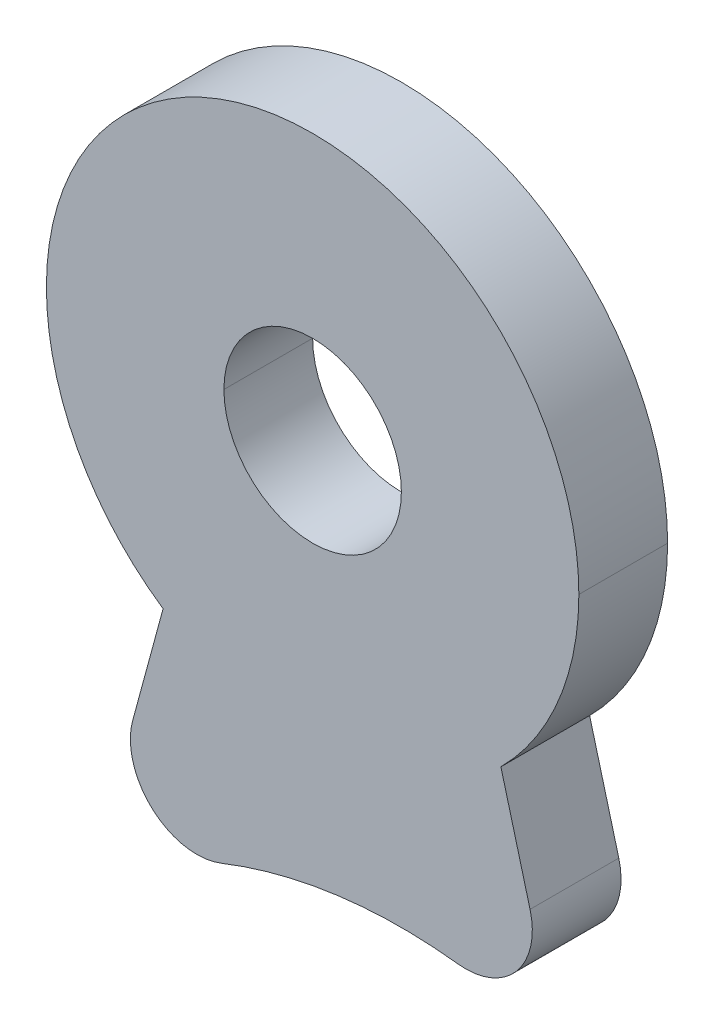
ISO-10303-21;
HEADER;
FILE_DESCRIPTION(('STEP AP214'),'2;1');
FILE_NAME('part.step','',(''),(''),'','','');
FILE_SCHEMA(('AUTOMOTIVE_DESIGN { 1 0 10303 214 1 1 1 1 }'));
ENDSEC;
DATA;
#1=APPLICATION_CONTEXT('core data for automotive mechanical design processes');
#2=APPLICATION_PROTOCOL_DEFINITION('international standard','automotive_design',2000,#1);
#3=PRODUCT_CONTEXT('',#1,'mechanical');
#4=PRODUCT('Part','Part','',(#3));
#5=PRODUCT_RELATED_PRODUCT_CATEGORY('part','',(#4));
#6=PRODUCT_DEFINITION_FORMATION('','',#4);
#7=PRODUCT_DEFINITION_CONTEXT('part definition',#1,'design');
#8=PRODUCT_DEFINITION('design','',#6,#7);
#9=PRODUCT_DEFINITION_SHAPE('','',#8);
#10=(LENGTH_UNIT() NAMED_UNIT(*) SI_UNIT(.MILLI.,.METRE.));
#11=(NAMED_UNIT(*) PLANE_ANGLE_UNIT() SI_UNIT($,.RADIAN.));
#12=(NAMED_UNIT(*) SI_UNIT($,.STERADIAN.) SOLID_ANGLE_UNIT());
#13=UNCERTAINTY_MEASURE_WITH_UNIT(LENGTH_MEASURE(1.E-05),#10,'distance_accuracy_value','');
#14=(GEOMETRIC_REPRESENTATION_CONTEXT(3) GLOBAL_UNCERTAINTY_ASSIGNED_CONTEXT((#13)) GLOBAL_UNIT_ASSIGNED_CONTEXT((#10,
#11,#12)) REPRESENTATION_CONTEXT('',''));
#15=CARTESIAN_POINT('',(0.,0.,0.));
#16=DIRECTION('',(0.,0.,1.));
#17=DIRECTION('',(1.,0.,0.));
#18=AXIS2_PLACEMENT_3D('',#15,#16,#17);
#19=CARTESIAN_POINT('',(-170.965044068025,-32.2566862708738,2.));
#20=DIRECTION('',(0.,0.,-1.));
#21=DIRECTION('',(-1.,0.,0.));
#22=AXIS2_PLACEMENT_3D('',#19,#20,#21);
#23=CYLINDRICAL_SURFACE('',#22,1.5);
#24=CARTESIAN_POINT('',(-170.965044068025,-32.2566862708738,2.));
#25=DIRECTION('',(0.,0.,1.));
#26=DIRECTION('',(1.,0.,0.));
#27=AXIS2_PLACEMENT_3D('',#24,#25,#26);
#28=CIRCLE('',#27,1.5);
#29=CARTESIAN_POINT('',(-171.139188939347,-33.7465431646029,2.));
#30=VERTEX_POINT('',#29);
#31=CARTESIAN_POINT('',(-169.516155328566,-31.8684577033164,2.));
#32=VERTEX_POINT('',#31);
#33=EDGE_CURVE('E46',#30,#32,#28,.T.);
#34=ORIENTED_EDGE('',*,*,#33,.F.);
#35=DIRECTION('',(0.,0.,1.));
#36=VECTOR('',#35,1.);
#37=CARTESIAN_POINT('',(-171.139188939347,-33.7465431646029,2.));
#38=LINE('',#37,#36);
#39=CARTESIAN_POINT('',(-171.139188939347,-33.7465431646029,0.));
#40=VERTEX_POINT('',#39);
#41=EDGE_CURVE('E184',#40,#30,#38,.T.);
#42=ORIENTED_EDGE('',*,*,#41,.F.);
#43=CARTESIAN_POINT('',(-170.965044068025,-32.2566862708738,0.));
#44=DIRECTION('',(0.,0.,-1.));
#45=DIRECTION('',(1.,0.,0.));
#46=AXIS2_PLACEMENT_3D('',#43,#44,#45);
#47=CIRCLE('',#46,1.5);
#48=CARTESIAN_POINT('',(-169.516155328566,-31.8684577033164,0.));
#49=VERTEX_POINT('',#48);
#50=EDGE_CURVE('E10',#49,#40,#47,.T.);
#51=ORIENTED_EDGE('',*,*,#50,.F.);
#52=DIRECTION('',(0.,0.,-1.));
#53=VECTOR('',#52,1.);
#54=CARTESIAN_POINT('',(-169.516155328566,-31.8684577033164,0.));
#55=LINE('',#54,#53);
#56=EDGE_CURVE('E221',#32,#49,#55,.T.);
#57=ORIENTED_EDGE('',*,*,#56,.F.);
#58=EDGE_LOOP('',(#34,#42,#51,#57));
#59=FACE_BOUND('',#58,.T.);
#60=ADVANCED_FACE('F15',(#59),#23,.T.);
#61=CARTESIAN_POINT('',(-177.023436755782,-33.0521843765813,2.));
#62=DIRECTION('',(0.,0.,-1.));
#63=DIRECTION('',(-1.,0.,0.));
#64=AXIS2_PLACEMENT_3D('',#61,#62,#63);
#65=CYLINDRICAL_SURFACE('',#64,1.5);
#66=DIRECTION('',(0.,0.,-1.));
#67=VECTOR('',#66,1.);
#68=CARTESIAN_POINT('',(-178.523436755782,-33.0521843765813,2.));
#69=LINE('',#68,#67);
#70=CARTESIAN_POINT('',(-178.523436755782,-33.0521843765813,2.));
#71=VERTEX_POINT('',#70);
#72=CARTESIAN_POINT('',(-178.523436755782,-33.0521843765813,0.));
#73=VERTEX_POINT('',#72);
#74=EDGE_CURVE('E274',#71,#73,#69,.T.);
#75=ORIENTED_EDGE('',*,*,#74,.F.);
#76=CARTESIAN_POINT('',(-177.023436755782,-33.0521843765813,2.));
#77=DIRECTION('',(0.,0.,1.));
#78=DIRECTION('',(1.,0.,0.));
#79=AXIS2_PLACEMENT_3D('',#76,#77,#78);
#80=CIRCLE('',#79,1.5);
#81=CARTESIAN_POINT('',(-178.471059683422,-32.6592621713409,2.));
#82=VERTEX_POINT('',#81);
#83=EDGE_CURVE('E228',#82,#71,#80,.T.);
#84=ORIENTED_EDGE('',*,*,#83,.F.);
#85=DIRECTION('',(0.,0.,1.));
#86=VECTOR('',#85,1.);
#87=CARTESIAN_POINT('',(-178.471059683422,-32.6592621713409,2.));
#88=LINE('',#87,#86);
#89=CARTESIAN_POINT('',(-178.471059683422,-32.6592621713409,0.));
#90=VERTEX_POINT('',#89);
#91=EDGE_CURVE('E199',#90,#82,#88,.T.);
#92=ORIENTED_EDGE('',*,*,#91,.F.);
#93=CARTESIAN_POINT('',(-177.023436755782,-33.0521843765813,0.));
#94=DIRECTION('',(0.,0.,-1.));
#95=DIRECTION('',(1.,0.,0.));
#96=AXIS2_PLACEMENT_3D('',#93,#94,#95);
#97=CIRCLE('',#96,1.5);
#98=EDGE_CURVE('E18',#73,#90,#97,.T.);
#99=ORIENTED_EDGE('',*,*,#98,.F.);
#100=EDGE_LOOP('',(#75,#84,#92,#99));
#101=FACE_BOUND('',#100,.T.);
#102=ADVANCED_FACE('F243',(#101),#65,.T.);
#103=CARTESIAN_POINT('',(0.,0.,0.));
#104=DIRECTION('',(0.,0.,1.));
#105=DIRECTION('',(1.,0.,0.));
#106=AXIS2_PLACEMENT_3D('',#103,#104,#105);
#107=PLANE('',#106);
#108=CARTESIAN_POINT('',(-174.416251328011,-25.1721603850015,0.));
#109=DIRECTION('',(0.,0.,1.));
#110=DIRECTION('',(1.,0.,0.));
#111=AXIS2_PLACEMENT_3D('',#108,#109,#110);
#112=CIRCLE('',#111,2.);
#113=CARTESIAN_POINT('',(-176.416251328011,-25.1721603850015,0.));
#114=VERTEX_POINT('',#113);
#115=CARTESIAN_POINT('',(-172.416251328011,-25.1721603850015,0.));
#116=VERTEX_POINT('',#115);
#117=EDGE_CURVE('E142',#114,#116,#112,.T.);
#118=ORIENTED_EDGE('',*,*,#117,.T.);
#119=CARTESIAN_POINT('',(-174.416251328011,-25.1721603850015,0.));
#120=DIRECTION('',(0.,0.,1.));
#121=DIRECTION('',(1.,0.,0.));
#122=AXIS2_PLACEMENT_3D('',#119,#120,#121);
#123=CIRCLE('',#122,2.);
#124=EDGE_CURVE('E128',#116,#114,#123,.T.);
#125=ORIENTED_EDGE('',*,*,#124,.T.);
#126=EDGE_LOOP('',(#118,#125));
#127=FACE_BOUND('',#126,.T.);
#128=CARTESIAN_POINT('',(-172.416251329011,-44.6721603850015,0.));
#129=DIRECTION('',(0.,0.,-1.));
#130=DIRECTION('',(1.,0.,0.));
#131=AXIS2_PLACEMENT_3D('',#128,#129,#130);
#132=CIRCLE('',#131,10.9999999997165);
#133=CARTESIAN_POINT('',(-176.470574504557,-34.4465814976233,0.));
#134=VERTEX_POINT('',#133);
#135=EDGE_CURVE('E188',#134,#40,#132,.T.);
#136=ORIENTED_EDGE('',*,*,#135,.F.);
#137=CARTESIAN_POINT('',(-177.023436755782,-33.0521843765813,0.));
#138=DIRECTION('',(0.,0.,-1.));
#139=DIRECTION('',(1.,0.,0.));
#140=AXIS2_PLACEMENT_3D('',#137,#138,#139);
#141=CIRCLE('',#140,1.5);
#142=EDGE_CURVE('E239',#134,#73,#141,.T.);
#143=ORIENTED_EDGE('',*,*,#142,.T.);
#144=ORIENTED_EDGE('',*,*,#98,.T.);
#145=DIRECTION('',(-0.261948136826911,-0.96508195176001,0.));
#146=VECTOR('',#145,1.);
#147=CARTESIAN_POINT('',(-157.968634140736,42.8767622426203,0.));
#148=LINE('',#147,#146);
#149=CARTESIAN_POINT('',(-177.78627055048,-30.1363290404956,0.));
#150=VERTEX_POINT('',#149);
#151=EDGE_CURVE('E198',#150,#90,#148,.T.);
#152=ORIENTED_EDGE('',*,*,#151,.F.);
#153=CARTESIAN_POINT('',(-174.416251328011,-25.1721603850015,0.));
#154=DIRECTION('',(0.,0.,1.));
#155=DIRECTION('',(1.,0.,0.));
#156=AXIS2_PLACEMENT_3D('',#153,#154,#155);
#157=CIRCLE('',#156,6.);
#158=CARTESIAN_POINT('',(-180.416251328011,-25.1721603850015,0.));
#159=VERTEX_POINT('',#158);
#160=EDGE_CURVE('E161',#159,#150,#157,.T.);
#161=ORIENTED_EDGE('',*,*,#160,.F.);
#162=CARTESIAN_POINT('',(-174.416251328011,-25.1721603850015,0.));
#163=DIRECTION('',(0.,0.,1.));
#164=DIRECTION('',(1.,0.,0.));
#165=AXIS2_PLACEMENT_3D('',#162,#163,#164);
#166=CIRCLE('',#165,6.);
#167=CARTESIAN_POINT('',(-168.416251328011,-25.1721603850015,0.));
#168=VERTEX_POINT('',#167);
#169=EDGE_CURVE('E171',#168,#159,#166,.T.);
#170=ORIENTED_EDGE('',*,*,#169,.F.);
#171=CARTESIAN_POINT('',(-174.416251328011,-25.1721603850015,0.));
#172=DIRECTION('',(0.,0.,1.));
#173=DIRECTION('',(1.,0.,0.));
#174=AXIS2_PLACEMENT_3D('',#171,#172,#173);
#175=CIRCLE('',#174,6.);
#176=CARTESIAN_POINT('',(-170.173610641152,-29.4148010723819,0.));
#177=VERTEX_POINT('',#176);
#178=EDGE_CURVE('E195',#177,#168,#175,.T.);
#179=ORIENTED_EDGE('',*,*,#178,.F.);
#180=DIRECTION('',(0.258819045038276,-0.965925826306283,0.));
#181=VECTOR('',#180,1.);
#182=CARTESIAN_POINT('',(-166.127840527117,-44.5138206977246,0.));
#183=LINE('',#182,#181);
#184=EDGE_CURVE('E224',#177,#49,#183,.T.);
#185=ORIENTED_EDGE('',*,*,#184,.T.);
#186=ORIENTED_EDGE('',*,*,#50,.T.);
#187=EDGE_LOOP('',(#136,#143,#144,#152,#161,#170,#179,#185,#186));
#188=FACE_BOUND('',#187,.T.);
#189=ADVANCED_FACE('F143',(#127,#188),#107,.F.);
#190=CARTESIAN_POINT('',(0.,0.,2.));
#191=DIRECTION('',(0.,0.,1.));
#192=DIRECTION('',(1.,0.,0.));
#193=AXIS2_PLACEMENT_3D('',#190,#191,#192);
#194=PLANE('',#193);
#195=CARTESIAN_POINT('',(-174.416251328011,-25.1721603850015,2.));
#196=DIRECTION('',(0.,0.,1.));
#197=DIRECTION('',(1.,0.,0.));
#198=AXIS2_PLACEMENT_3D('',#195,#196,#197);
#199=CIRCLE('',#198,2.);
#200=CARTESIAN_POINT('',(-176.416251328011,-25.1721603850015,2.));
#201=VERTEX_POINT('',#200);
#202=CARTESIAN_POINT('',(-172.416251328011,-25.1721603850015,2.));
#203=VERTEX_POINT('',#202);
#204=EDGE_CURVE('E150',#201,#203,#199,.T.);
#205=ORIENTED_EDGE('',*,*,#204,.F.);
#206=CARTESIAN_POINT('',(-174.416251328011,-25.1721603850015,2.));
#207=DIRECTION('',(0.,0.,1.));
#208=DIRECTION('',(1.,0.,0.));
#209=AXIS2_PLACEMENT_3D('',#206,#207,#208);
#210=CIRCLE('',#209,2.);
#211=EDGE_CURVE('E140',#203,#201,#210,.T.);
#212=ORIENTED_EDGE('',*,*,#211,.F.);
#213=EDGE_LOOP('',(#205,#212));
#214=FACE_BOUND('',#213,.T.);
#215=DIRECTION('',(-0.261948136826911,-0.96508195176001,0.));
#216=VECTOR('',#215,1.);
#217=CARTESIAN_POINT('',(-157.968634140736,42.8767622426203,2.));
#218=LINE('',#217,#216);
#219=CARTESIAN_POINT('',(-177.78627055048,-30.1363290404956,2.));
#220=VERTEX_POINT('',#219);
#221=EDGE_CURVE('E203',#220,#82,#218,.T.);
#222=ORIENTED_EDGE('',*,*,#221,.T.);
#223=ORIENTED_EDGE('',*,*,#83,.T.);
#224=CARTESIAN_POINT('',(-177.023436755782,-33.0521843765813,2.));
#225=DIRECTION('',(0.,0.,1.));
#226=DIRECTION('',(1.,0.,0.));
#227=AXIS2_PLACEMENT_3D('',#224,#225,#226);
#228=CIRCLE('',#227,1.5);
#229=CARTESIAN_POINT('',(-176.470574504557,-34.4465814976233,2.));
#230=VERTEX_POINT('',#229);
#231=EDGE_CURVE('E280',#71,#230,#228,.T.);
#232=ORIENTED_EDGE('',*,*,#231,.T.);
#233=CARTESIAN_POINT('',(-172.416251329011,-44.6721603850015,2.));
#234=DIRECTION('',(0.,0.,-1.));
#235=DIRECTION('',(1.,0.,0.));
#236=AXIS2_PLACEMENT_3D('',#233,#234,#235);
#237=CIRCLE('',#236,10.9999999997165);
#238=EDGE_CURVE('E210',#230,#30,#237,.T.);
#239=ORIENTED_EDGE('',*,*,#238,.T.);
#240=ORIENTED_EDGE('',*,*,#33,.T.);
#241=DIRECTION('',(0.258819045038276,-0.965925826306283,0.));
#242=VECTOR('',#241,1.);
#243=CARTESIAN_POINT('',(-166.127840527117,-44.5138206977246,2.));
#244=LINE('',#243,#242);
#245=CARTESIAN_POINT('',(-170.173610641152,-29.4148010723819,2.));
#246=VERTEX_POINT('',#245);
#247=EDGE_CURVE('E139',#246,#32,#244,.T.);
#248=ORIENTED_EDGE('',*,*,#247,.F.);
#249=CARTESIAN_POINT('',(-174.416251328011,-25.1721603850015,2.));
#250=DIRECTION('',(0.,0.,1.));
#251=DIRECTION('',(1.,0.,0.));
#252=AXIS2_PLACEMENT_3D('',#249,#250,#251);
#253=CIRCLE('',#252,6.);
#254=CARTESIAN_POINT('',(-168.416251328011,-25.1721603850015,2.));
#255=VERTEX_POINT('',#254);
#256=EDGE_CURVE('E183',#246,#255,#253,.T.);
#257=ORIENTED_EDGE('',*,*,#256,.T.);
#258=CARTESIAN_POINT('',(-174.416251328011,-25.1721603850015,2.));
#259=DIRECTION('',(0.,0.,1.));
#260=DIRECTION('',(1.,0.,0.));
#261=AXIS2_PLACEMENT_3D('',#258,#259,#260);
#262=CIRCLE('',#261,6.);
#263=CARTESIAN_POINT('',(-180.416251328011,-25.1721603850015,2.));
#264=VERTEX_POINT('',#263);
#265=EDGE_CURVE('E172',#255,#264,#262,.T.);
#266=ORIENTED_EDGE('',*,*,#265,.T.);
#267=CARTESIAN_POINT('',(-174.416251328011,-25.1721603850015,2.));
#268=DIRECTION('',(0.,0.,1.));
#269=DIRECTION('',(1.,0.,0.));
#270=AXIS2_PLACEMENT_3D('',#267,#268,#269);
#271=CIRCLE('',#270,6.);
#272=EDGE_CURVE('E166',#264,#220,#271,.T.);
#273=ORIENTED_EDGE('',*,*,#272,.T.);
#274=EDGE_LOOP('',(#222,#223,#232,#239,#240,#248,#257,#266,#273));
#275=FACE_BOUND('',#274,.T.);
#276=ADVANCED_FACE('F432',(#214,#275),#194,.T.);
#277=CARTESIAN_POINT('',(-166.127840527117,-44.5138206977246,2.));
#278=DIRECTION('',(0.965925826306283,0.258819045038276,0.));
#279=DIRECTION('',(0.,0.,-1.));
#280=AXIS2_PLACEMENT_3D('',#277,#278,#279);
#281=PLANE('',#280);
#282=ORIENTED_EDGE('',*,*,#247,.T.);
#283=ORIENTED_EDGE('',*,*,#56,.T.);
#284=ORIENTED_EDGE('',*,*,#184,.F.);
#285=DIRECTION('',(0.,0.,-1.));
#286=VECTOR('',#285,1.);
#287=CARTESIAN_POINT('',(-170.173610641152,-29.4148010723819,2.));
#288=LINE('',#287,#286);
#289=EDGE_CURVE('E191',#246,#177,#288,.T.);
#290=ORIENTED_EDGE('',*,*,#289,.F.);
#291=EDGE_LOOP('',(#282,#283,#284,#290));
#292=FACE_BOUND('',#291,.T.);
#293=ADVANCED_FACE('F263',(#292),#281,.T.);
#294=CARTESIAN_POINT('',(-174.416251328011,-25.1721603850015,2.));
#295=DIRECTION('',(0.,0.,-1.));
#296=DIRECTION('',(-1.,0.,0.));
#297=AXIS2_PLACEMENT_3D('',#294,#295,#296);
#298=CYLINDRICAL_SURFACE('',#297,2.);
#299=DIRECTION('',(0.,0.,-1.));
#300=VECTOR('',#299,1.);
#301=CARTESIAN_POINT('',(-172.416251328011,-25.1721603850015,2.));
#302=LINE('',#301,#300);
#303=EDGE_CURVE('E132',#203,#116,#302,.T.);
#304=ORIENTED_EDGE('',*,*,#303,.F.);
#305=ORIENTED_EDGE('',*,*,#211,.T.);
#306=DIRECTION('',(0.,0.,-1.));
#307=VECTOR('',#306,1.);
#308=CARTESIAN_POINT('',(-176.416251328011,-25.1721603850015,2.));
#309=LINE('',#308,#307);
#310=EDGE_CURVE('E135',#201,#114,#309,.T.);
#311=ORIENTED_EDGE('',*,*,#310,.T.);
#312=ORIENTED_EDGE('',*,*,#124,.F.);
#313=EDGE_LOOP('',(#304,#305,#311,#312));
#314=FACE_BOUND('',#313,.T.);
#315=ADVANCED_FACE('F130',(#314),#298,.F.);
#316=CARTESIAN_POINT('',(-172.416251329011,-44.6721603850015,2.));
#317=DIRECTION('',(0.,0.,-1.));
#318=DIRECTION('',(-1.,0.,0.));
#319=AXIS2_PLACEMENT_3D('',#316,#317,#318);
#320=CYLINDRICAL_SURFACE('',#319,10.9999999997165);
#321=ORIENTED_EDGE('',*,*,#238,.F.);
#322=DIRECTION('',(0.,0.,-1.));
#323=VECTOR('',#322,1.);
#324=CARTESIAN_POINT('',(-176.470574504557,-34.4465814976233,2.));
#325=LINE('',#324,#323);
#326=EDGE_CURVE('E157',#230,#134,#325,.T.);
#327=ORIENTED_EDGE('',*,*,#326,.T.);
#328=ORIENTED_EDGE('',*,*,#135,.T.);
#329=ORIENTED_EDGE('',*,*,#41,.T.);
#330=EDGE_LOOP('',(#321,#327,#328,#329));
#331=FACE_BOUND('',#330,.T.);
#332=ADVANCED_FACE('F266',(#331),#320,.F.);
#333=CARTESIAN_POINT('',(-157.968634140736,42.8767622426203,2.));
#334=DIRECTION('',(0.96508195176001,-0.261948136826911,0.));
#335=DIRECTION('',(0.,0.,-1.));
#336=AXIS2_PLACEMENT_3D('',#333,#334,#335);
#337=PLANE('',#336);
#338=ORIENTED_EDGE('',*,*,#151,.T.);
#339=ORIENTED_EDGE('',*,*,#91,.T.);
#340=ORIENTED_EDGE('',*,*,#221,.F.);
#341=DIRECTION('',(0.,0.,-1.));
#342=VECTOR('',#341,1.);
#343=CARTESIAN_POINT('',(-177.78627055048,-30.1363290404956,2.));
#344=LINE('',#343,#342);
#345=EDGE_CURVE('E165',#220,#150,#344,.T.);
#346=ORIENTED_EDGE('',*,*,#345,.T.);
#347=EDGE_LOOP('',(#338,#339,#340,#346));
#348=FACE_BOUND('',#347,.T.);
#349=ADVANCED_FACE('F245',(#348),#337,.F.);
#350=CARTESIAN_POINT('',(-174.416251328011,-25.1721603850015,2.));
#351=DIRECTION('',(0.,0.,-1.));
#352=DIRECTION('',(-1.,0.,0.));
#353=AXIS2_PLACEMENT_3D('',#350,#351,#352);
#354=CYLINDRICAL_SURFACE('',#353,6.);
#355=DIRECTION('',(0.,0.,-1.));
#356=VECTOR('',#355,1.);
#357=CARTESIAN_POINT('',(-168.416251328011,-25.1721603850015,2.));
#358=LINE('',#357,#356);
#359=EDGE_CURVE('E167',#255,#168,#358,.T.);
#360=ORIENTED_EDGE('',*,*,#359,.F.);
#361=ORIENTED_EDGE('',*,*,#256,.F.);
#362=ORIENTED_EDGE('',*,*,#289,.T.);
#363=ORIENTED_EDGE('',*,*,#178,.T.);
#364=EDGE_LOOP('',(#360,#361,#362,#363));
#365=FACE_BOUND('',#364,.T.);
#366=ADVANCED_FACE('F260',(#365),#354,.T.);
#367=CARTESIAN_POINT('',(-174.416251328011,-25.1721603850015,2.));
#368=DIRECTION('',(0.,0.,-1.));
#369=DIRECTION('',(-1.,0.,0.));
#370=AXIS2_PLACEMENT_3D('',#367,#368,#369);
#371=CYLINDRICAL_SURFACE('',#370,6.);
#372=ORIENTED_EDGE('',*,*,#272,.F.);
#373=DIRECTION('',(0.,0.,-1.));
#374=VECTOR('',#373,1.);
#375=CARTESIAN_POINT('',(-180.416251328011,-25.1721603850015,2.));
#376=LINE('',#375,#374);
#377=EDGE_CURVE('E176',#264,#159,#376,.T.);
#378=ORIENTED_EDGE('',*,*,#377,.T.);
#379=ORIENTED_EDGE('',*,*,#160,.T.);
#380=ORIENTED_EDGE('',*,*,#345,.F.);
#381=EDGE_LOOP('',(#372,#378,#379,#380));
#382=FACE_BOUND('',#381,.T.);
#383=ADVANCED_FACE('F249',(#382),#371,.T.);
#384=CARTESIAN_POINT('',(-174.416251328011,-25.1721603850015,2.));
#385=DIRECTION('',(0.,0.,-1.));
#386=DIRECTION('',(-1.,0.,0.));
#387=AXIS2_PLACEMENT_3D('',#384,#385,#386);
#388=CYLINDRICAL_SURFACE('',#387,6.);
#389=ORIENTED_EDGE('',*,*,#265,.F.);
#390=ORIENTED_EDGE('',*,*,#359,.T.);
#391=ORIENTED_EDGE('',*,*,#169,.T.);
#392=ORIENTED_EDGE('',*,*,#377,.F.);
#393=EDGE_LOOP('',(#389,#390,#391,#392));
#394=FACE_BOUND('',#393,.T.);
#395=ADVANCED_FACE('F256',(#394),#388,.T.);
#396=CARTESIAN_POINT('',(-174.416251328011,-25.1721603850015,2.));
#397=DIRECTION('',(0.,0.,-1.));
#398=DIRECTION('',(-1.,0.,0.));
#399=AXIS2_PLACEMENT_3D('',#396,#397,#398);
#400=CYLINDRICAL_SURFACE('',#399,2.);
#401=ORIENTED_EDGE('',*,*,#204,.T.);
#402=ORIENTED_EDGE('',*,*,#303,.T.);
#403=ORIENTED_EDGE('',*,*,#117,.F.);
#404=ORIENTED_EDGE('',*,*,#310,.F.);
#405=EDGE_LOOP('',(#401,#402,#403,#404));
#406=FACE_BOUND('',#405,.T.);
#407=ADVANCED_FACE('F148',(#406),#400,.F.);
#408=CARTESIAN_POINT('',(-177.023436755782,-33.0521843765813,2.));
#409=DIRECTION('',(0.,0.,-1.));
#410=DIRECTION('',(-1.,0.,0.));
#411=AXIS2_PLACEMENT_3D('',#408,#409,#410);
#412=CYLINDRICAL_SURFACE('',#411,1.5);
#413=ORIENTED_EDGE('',*,*,#231,.F.);
#414=ORIENTED_EDGE('',*,*,#74,.T.);
#415=ORIENTED_EDGE('',*,*,#142,.F.);
#416=ORIENTED_EDGE('',*,*,#326,.F.);
#417=EDGE_LOOP('',(#413,#414,#415,#416));
#418=FACE_BOUND('',#417,.T.);
#419=ADVANCED_FACE('F273',(#418),#412,.T.);
#420=CLOSED_SHELL('',(#60,#102,#189,#276,#293,#315,#332,#349,#366,#383,#395,#407,#419));
#421=MANIFOLD_SOLID_BREP('B1',#420);
#422=ADVANCED_BREP_SHAPE_REPRESENTATION('',(#18,#421),#14);
#423=SHAPE_DEFINITION_REPRESENTATION(#9,#422);
ENDSEC;
END-ISO-10303-21;
